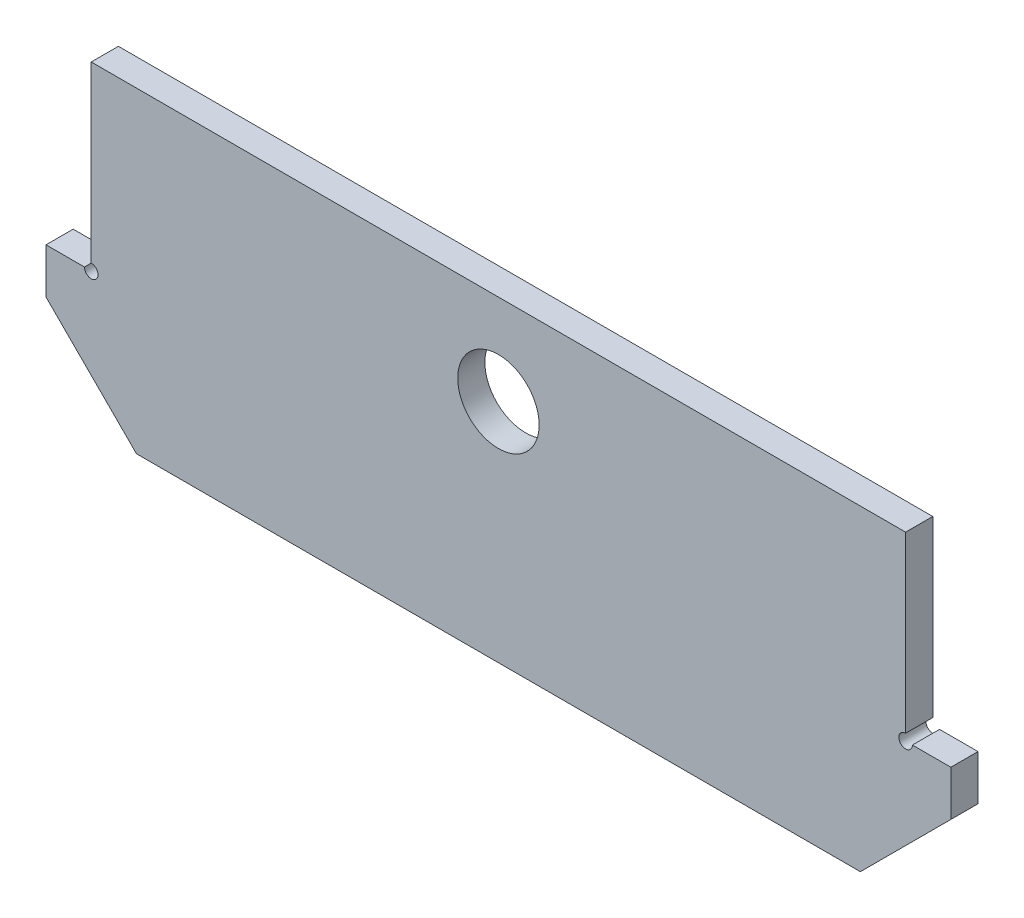
ISO-10303-21;
HEADER;
FILE_DESCRIPTION(('STEP AP214'),'2;1');
FILE_NAME('part.step','',(''),(''),'','','');
FILE_SCHEMA(('AUTOMOTIVE_DESIGN { 1 0 10303 214 1 1 1 1 }'));
ENDSEC;
DATA;
#1=APPLICATION_CONTEXT('core data for automotive mechanical design processes');
#2=APPLICATION_PROTOCOL_DEFINITION('international standard','automotive_design',2000,#1);
#3=PRODUCT_CONTEXT('',#1,'mechanical');
#4=PRODUCT('Part','Part','',(#3));
#5=PRODUCT_RELATED_PRODUCT_CATEGORY('part','',(#4));
#6=PRODUCT_DEFINITION_FORMATION('','',#4);
#7=PRODUCT_DEFINITION_CONTEXT('part definition',#1,'design');
#8=PRODUCT_DEFINITION('design','',#6,#7);
#9=PRODUCT_DEFINITION_SHAPE('','',#8);
#10=(LENGTH_UNIT() NAMED_UNIT(*) SI_UNIT(.MILLI.,.METRE.));
#11=(NAMED_UNIT(*) PLANE_ANGLE_UNIT() SI_UNIT($,.RADIAN.));
#12=(NAMED_UNIT(*) SI_UNIT($,.STERADIAN.) SOLID_ANGLE_UNIT());
#13=UNCERTAINTY_MEASURE_WITH_UNIT(LENGTH_MEASURE(1.E-05),#10,'distance_accuracy_value','');
#14=(GEOMETRIC_REPRESENTATION_CONTEXT(3) GLOBAL_UNCERTAINTY_ASSIGNED_CONTEXT((#13)) GLOBAL_UNIT_ASSIGNED_CONTEXT((#10,
#11,#12)) REPRESENTATION_CONTEXT('',''));
#15=CARTESIAN_POINT('',(0.,0.,0.));
#16=DIRECTION('',(0.,0.,1.));
#17=DIRECTION('',(1.,0.,0.));
#18=AXIS2_PLACEMENT_3D('',#15,#16,#17);
#19=CARTESIAN_POINT('',(234.558896816398,-1478.42666599479,-18.956397504259));
#20=DIRECTION('',(0.,0.,1.));
#21=DIRECTION('',(1.,0.,0.));
#22=AXIS2_PLACEMENT_3D('',#19,#20,#21);
#23=CYLINDRICAL_SURFACE('',#22,1.5000000000003);
#24=DIRECTION('',(0.,0.,1.));
#25=VECTOR('',#24,1.);
#26=CARTESIAN_POINT('',(234.558896816395,-1476.92666599477,-18.956397504259));
#27=LINE('',#26,#25);
#28=CARTESIAN_POINT('',(234.558896816395,-1476.92666599477,-18.956397504259));
#29=VERTEX_POINT('',#28);
#30=CARTESIAN_POINT('',(234.558896816395,-1476.92666599477,-12.956397504259));
#31=VERTEX_POINT('',#30);
#32=EDGE_CURVE('E223',#29,#31,#27,.T.);
#33=ORIENTED_EDGE('',*,*,#32,.T.);
#34=CARTESIAN_POINT('',(234.558896816398,-1478.42666599479,-12.956397504259));
#35=DIRECTION('',(0.,0.,1.));
#36=DIRECTION('',(1.,0.,0.));
#37=AXIS2_PLACEMENT_3D('',#34,#35,#36);
#38=CIRCLE('',#37,1.5000000000003);
#39=CARTESIAN_POINT('',(236.058896816417,-1478.42666599477,-12.956397504259));
#40=VERTEX_POINT('',#39);
#41=EDGE_CURVE('E217',#31,#40,#38,.T.);
#42=ORIENTED_EDGE('',*,*,#41,.T.);
#43=DIRECTION('',(0.,0.,1.));
#44=VECTOR('',#43,1.);
#45=CARTESIAN_POINT('',(236.058896816417,-1478.42666599477,-18.956397504259));
#46=LINE('',#45,#44);
#47=CARTESIAN_POINT('',(236.058896816417,-1478.42666599477,-18.956397504259));
#48=VERTEX_POINT('',#47);
#49=EDGE_CURVE('E12',#48,#40,#46,.T.);
#50=ORIENTED_EDGE('',*,*,#49,.F.);
#51=CARTESIAN_POINT('',(234.558896816398,-1478.42666599479,-18.956397504259));
#52=DIRECTION('',(0.,0.,1.));
#53=DIRECTION('',(1.,0.,0.));
#54=AXIS2_PLACEMENT_3D('',#51,#52,#53);
#55=CIRCLE('',#54,1.5000000000003);
#56=EDGE_CURVE('E259',#29,#48,#55,.T.);
#57=ORIENTED_EDGE('',*,*,#56,.F.);
#58=EDGE_LOOP('',(#33,#42,#50,#57));
#59=FACE_BOUND('',#58,.T.);
#60=ADVANCED_FACE('F114',(#59),#23,.F.);
#61=CARTESIAN_POINT('',(-399855.44110319,-1478.42666600366,-18.956397504259));
#62=DIRECTION('',(0.,-1.,0.));
#63=DIRECTION('',(1.,0.,0.));
#64=AXIS2_PLACEMENT_3D('',#61,#62,#63);
#65=PLANE('',#64);
#66=ORIENTED_EDGE('',*,*,#49,.T.);
#67=DIRECTION('',(1.,0.,0.));
#68=VECTOR('',#67,1.);
#69=CARTESIAN_POINT('',(-399855.44110319,-1478.42666600366,-12.956397504259));
#70=LINE('',#69,#68);
#71=CARTESIAN_POINT('',(244.558896816386,-1478.42666599479,-12.956397504259));
#72=VERTEX_POINT('',#71);
#73=EDGE_CURVE('E206',#40,#72,#70,.T.);
#74=ORIENTED_EDGE('',*,*,#73,.T.);
#75=DIRECTION('',(0.,0.,1.));
#76=VECTOR('',#75,1.);
#77=CARTESIAN_POINT('',(244.558896816386,-1478.42666599479,-18.956397504259));
#78=LINE('',#77,#76);
#79=CARTESIAN_POINT('',(244.558896816386,-1478.42666599479,-18.956397504259));
#80=VERTEX_POINT('',#79);
#81=EDGE_CURVE('E121',#80,#72,#78,.T.);
#82=ORIENTED_EDGE('',*,*,#81,.F.);
#83=DIRECTION('',(1.,0.,0.));
#84=VECTOR('',#83,1.);
#85=CARTESIAN_POINT('',(-399855.44110319,-1478.42666600366,-18.956397504259));
#86=LINE('',#85,#84);
#87=EDGE_CURVE('E207',#48,#80,#86,.T.);
#88=ORIENTED_EDGE('',*,*,#87,.F.);
#89=EDGE_LOOP('',(#66,#74,#82,#88));
#90=FACE_BOUND('',#89,.T.);
#91=ADVANCED_FACE('F204',(#90),#65,.F.);
#92=CARTESIAN_POINT('',(244.558896816386,-291723.426665995,-18.956397504259));
#93=DIRECTION('',(-1.,0.,0.));
#94=DIRECTION('',(0.,0.,1.));
#95=AXIS2_PLACEMENT_3D('',#92,#93,#94);
#96=PLANE('',#95);
#97=ORIENTED_EDGE('',*,*,#81,.T.);
#98=DIRECTION('',(0.,-1.,0.));
#99=VECTOR('',#98,1.);
#100=CARTESIAN_POINT('',(244.558896816386,-291723.426665995,-12.956397504259));
#101=LINE('',#100,#99);
#102=CARTESIAN_POINT('',(244.558896816443,-1488.42666599478,-12.956397504259));
#103=VERTEX_POINT('',#102);
#104=EDGE_CURVE('E221',#72,#103,#101,.T.);
#105=ORIENTED_EDGE('',*,*,#104,.T.);
#106=DIRECTION('',(0.,0.,1.));
#107=VECTOR('',#106,1.);
#108=CARTESIAN_POINT('',(244.558896816443,-1488.42666599478,-18.956397504259));
#109=LINE('',#108,#107);
#110=CARTESIAN_POINT('',(244.558896816443,-1488.42666599478,-18.956397504259));
#111=VERTEX_POINT('',#110);
#112=EDGE_CURVE('E302',#111,#103,#109,.T.);
#113=ORIENTED_EDGE('',*,*,#112,.F.);
#114=DIRECTION('',(0.,-1.,0.));
#115=VECTOR('',#114,1.);
#116=CARTESIAN_POINT('',(244.558896816386,-291723.426665995,-18.956397504259));
#117=LINE('',#116,#115);
#118=EDGE_CURVE('E262',#80,#111,#117,.T.);
#119=ORIENTED_EDGE('',*,*,#118,.F.);
#120=EDGE_LOOP('',(#97,#105,#113,#119));
#121=FACE_BOUND('',#120,.T.);
#122=ADVANCED_FACE('F305',(#121),#96,.F.);
#123=CARTESIAN_POINT('',(-344922.941103184,-346655.926665995,-18.956397504259));
#124=DIRECTION('',(-0.707106781186547,0.707106781186547,0.));
#125=DIRECTION('',(-0.707106781186548,-0.707106781186548,0.));
#126=AXIS2_PLACEMENT_3D('',#123,#124,#125);
#127=PLANE('',#126);
#128=ORIENTED_EDGE('',*,*,#112,.T.);
#129=DIRECTION('',(-0.707106781186548,-0.707106781186548,0.));
#130=VECTOR('',#129,1.);
#131=CARTESIAN_POINT('',(-344922.941103184,-346655.926665995,-12.956397504259));
#132=LINE('',#131,#130);
#133=CARTESIAN_POINT('',(224.558896816461,-1508.42666599476,-12.956397504259));
#134=VERTEX_POINT('',#133);
#135=EDGE_CURVE('E230',#103,#134,#132,.T.);
#136=ORIENTED_EDGE('',*,*,#135,.T.);
#137=DIRECTION('',(0.,0.,1.));
#138=VECTOR('',#137,1.);
#139=CARTESIAN_POINT('',(224.558896816461,-1508.42666599476,-18.956397504259));
#140=LINE('',#139,#138);
#141=CARTESIAN_POINT('',(224.558896816461,-1508.42666599476,-18.956397504259));
#142=VERTEX_POINT('',#141);
#143=EDGE_CURVE('E300',#142,#134,#140,.T.);
#144=ORIENTED_EDGE('',*,*,#143,.F.);
#145=DIRECTION('',(-0.707106781186548,-0.707106781186548,0.));
#146=VECTOR('',#145,1.);
#147=CARTESIAN_POINT('',(-344922.941103184,-346655.926665995,-18.956397504259));
#148=LINE('',#147,#146);
#149=EDGE_CURVE('E264',#111,#142,#148,.T.);
#150=ORIENTED_EDGE('',*,*,#149,.F.);
#151=EDGE_LOOP('',(#128,#136,#144,#150));
#152=FACE_BOUND('',#151,.T.);
#153=ADVANCED_FACE('F313',(#152),#127,.F.);
#154=CARTESIAN_POINT('',(-399855.441103184,-1508.42666599476,-18.956397504259));
#155=DIRECTION('',(0.,-1.,0.));
#156=DIRECTION('',(0.,0.,-1.));
#157=AXIS2_PLACEMENT_3D('',#154,#155,#156);
#158=PLANE('',#157);
#159=ORIENTED_EDGE('',*,*,#143,.T.);
#160=DIRECTION('',(1.,0.,0.));
#161=VECTOR('',#160,1.);
#162=CARTESIAN_POINT('',(-399855.441103184,-1508.42666599476,-12.956397504259));
#163=LINE('',#162,#161);
#164=CARTESIAN_POINT('',(64.5588968163651,-1508.42666599477,-12.956397504259));
#165=VERTEX_POINT('',#164);
#166=EDGE_CURVE('E233',#165,#134,#163,.T.);
#167=ORIENTED_EDGE('',*,*,#166,.F.);
#168=DIRECTION('',(0.,0.,1.));
#169=VECTOR('',#168,1.);
#170=CARTESIAN_POINT('',(64.5588968163651,-1508.42666599477,-18.956397504259));
#171=LINE('',#170,#169);
#172=CARTESIAN_POINT('',(64.5588968163651,-1508.42666599477,-18.956397504259));
#173=VERTEX_POINT('',#172);
#174=EDGE_CURVE('E298',#173,#165,#171,.T.);
#175=ORIENTED_EDGE('',*,*,#174,.F.);
#176=DIRECTION('',(1.,0.,0.));
#177=VECTOR('',#176,1.);
#178=CARTESIAN_POINT('',(-399855.441103184,-1508.42666599476,-18.956397504259));
#179=LINE('',#178,#177);
#180=EDGE_CURVE('E266',#173,#142,#179,.T.);
#181=ORIENTED_EDGE('',*,*,#180,.T.);
#182=EDGE_LOOP('',(#159,#167,#175,#181));
#183=FACE_BOUND('',#182,.T.);
#184=ADVANCED_FACE('F316',(#183),#158,.T.);
#185=CARTESIAN_POINT('',(-54787.9411031833,53344.073334005,-18.956397504259));
#186=DIRECTION('',(-0.707106781186548,-0.707106781186547,0.));
#187=DIRECTION('',(0.707106781186547,-0.707106781186548,0.));
#188=AXIS2_PLACEMENT_3D('',#185,#186,#187);
#189=PLANE('',#188);
#190=ORIENTED_EDGE('',*,*,#174,.T.);
#191=DIRECTION('',(0.707106781186547,-0.707106781186548,0.));
#192=VECTOR('',#191,1.);
#193=CARTESIAN_POINT('',(-54787.9411031833,53344.073334005,-12.956397504259));
#194=LINE('',#193,#192);
#195=CARTESIAN_POINT('',(44.5588968163975,-1488.42666599478,-12.956397504259));
#196=VERTEX_POINT('',#195);
#197=EDGE_CURVE('E236',#196,#165,#194,.T.);
#198=ORIENTED_EDGE('',*,*,#197,.F.);
#199=DIRECTION('',(0.,0.,1.));
#200=VECTOR('',#199,1.);
#201=CARTESIAN_POINT('',(44.5588968163975,-1488.42666599478,-18.956397504259));
#202=LINE('',#201,#200);
#203=CARTESIAN_POINT('',(44.5588968163975,-1488.42666599478,-18.956397504259));
#204=VERTEX_POINT('',#203);
#205=EDGE_CURVE('E296',#204,#196,#202,.T.);
#206=ORIENTED_EDGE('',*,*,#205,.F.);
#207=DIRECTION('',(0.707106781186547,-0.707106781186548,0.));
#208=VECTOR('',#207,1.);
#209=CARTESIAN_POINT('',(-54787.9411031833,53344.073334005,-18.956397504259));
#210=LINE('',#209,#208);
#211=EDGE_CURVE('E269',#204,#173,#210,.T.);
#212=ORIENTED_EDGE('',*,*,#211,.T.);
#213=EDGE_LOOP('',(#190,#198,#206,#212));
#214=FACE_BOUND('',#213,.T.);
#215=ADVANCED_FACE('F319',(#214),#189,.T.);
#216=CARTESIAN_POINT('',(44.5588968163975,-291723.426665995,-18.956397504259));
#217=DIRECTION('',(-1.,0.,0.));
#218=DIRECTION('',(0.,0.,1.));
#219=AXIS2_PLACEMENT_3D('',#216,#217,#218);
#220=PLANE('',#219);
#221=ORIENTED_EDGE('',*,*,#205,.T.);
#222=DIRECTION('',(0.,-1.,0.));
#223=VECTOR('',#222,1.);
#224=CARTESIAN_POINT('',(44.5588968163975,-291723.426665995,-12.956397504259));
#225=LINE('',#224,#223);
#226=CARTESIAN_POINT('',(44.5588968163975,-1478.4266659948,-12.956397504259));
#227=VERTEX_POINT('',#226);
#228=EDGE_CURVE('E239',#227,#196,#225,.T.);
#229=ORIENTED_EDGE('',*,*,#228,.F.);
#230=DIRECTION('',(0.,0.,1.));
#231=VECTOR('',#230,1.);
#232=CARTESIAN_POINT('',(44.5588968163975,-1478.4266659948,-18.956397504259));
#233=LINE('',#232,#231);
#234=CARTESIAN_POINT('',(44.5588968163975,-1478.4266659948,-18.956397504259));
#235=VERTEX_POINT('',#234);
#236=EDGE_CURVE('E294',#235,#227,#233,.T.);
#237=ORIENTED_EDGE('',*,*,#236,.F.);
#238=DIRECTION('',(0.,-1.,0.));
#239=VECTOR('',#238,1.);
#240=CARTESIAN_POINT('',(44.5588968163975,-291723.426665995,-18.956397504259));
#241=LINE('',#240,#239);
#242=EDGE_CURVE('E272',#235,#204,#241,.T.);
#243=ORIENTED_EDGE('',*,*,#242,.T.);
#244=EDGE_LOOP('',(#221,#229,#237,#243));
#245=FACE_BOUND('',#244,.T.);
#246=ADVANCED_FACE('F324',(#245),#220,.T.);
#247=CARTESIAN_POINT('',(-399855.441103177,-1478.42666598592,-18.956397504259));
#248=DIRECTION('',(0.,1.,0.));
#249=DIRECTION('',(-1.,0.,0.));
#250=AXIS2_PLACEMENT_3D('',#247,#248,#249);
#251=PLANE('',#250);
#252=ORIENTED_EDGE('',*,*,#236,.T.);
#253=DIRECTION('',(-1.,0.,0.));
#254=VECTOR('',#253,1.);
#255=CARTESIAN_POINT('',(-399855.441103177,-1478.42666598592,-12.956397504259));
#256=LINE('',#255,#254);
#257=CARTESIAN_POINT('',(53.0588968163976,-1478.4266659948,-12.956397504259));
#258=VERTEX_POINT('',#257);
#259=EDGE_CURVE('E242',#258,#227,#256,.T.);
#260=ORIENTED_EDGE('',*,*,#259,.F.);
#261=DIRECTION('',(0.,0.,1.));
#262=VECTOR('',#261,1.);
#263=CARTESIAN_POINT('',(53.0588968163976,-1478.4266659948,-18.956397504259));
#264=LINE('',#263,#262);
#265=CARTESIAN_POINT('',(53.0588968163976,-1478.4266659948,-18.956397504259));
#266=VERTEX_POINT('',#265);
#267=EDGE_CURVE('E292',#266,#258,#264,.T.);
#268=ORIENTED_EDGE('',*,*,#267,.F.);
#269=DIRECTION('',(-1.,0.,0.));
#270=VECTOR('',#269,1.);
#271=CARTESIAN_POINT('',(-399855.441103177,-1478.42666598592,-18.956397504259));
#272=LINE('',#271,#270);
#273=EDGE_CURVE('E275',#266,#235,#272,.T.);
#274=ORIENTED_EDGE('',*,*,#273,.T.);
#275=EDGE_LOOP('',(#252,#260,#268,#274));
#276=FACE_BOUND('',#275,.T.);
#277=ADVANCED_FACE('F328',(#276),#251,.T.);
#278=CARTESIAN_POINT('',(54.5588968163975,-1478.42666599479,-18.956397504259));
#279=DIRECTION('',(0.,0.,1.));
#280=DIRECTION('',(1.,0.,0.));
#281=AXIS2_PLACEMENT_3D('',#278,#279,#280);
#282=CYLINDRICAL_SURFACE('',#281,1.49999999999983);
#283=ORIENTED_EDGE('',*,*,#267,.T.);
#284=CARTESIAN_POINT('',(54.5588968163975,-1478.42666599479,-12.956397504259));
#285=DIRECTION('',(0.,0.,1.));
#286=DIRECTION('',(1.,0.,0.));
#287=AXIS2_PLACEMENT_3D('',#284,#285,#286);
#288=CIRCLE('',#287,1.49999999999983);
#289=CARTESIAN_POINT('',(54.5588968163884,-1476.92666599477,-12.956397504259));
#290=VERTEX_POINT('',#289);
#291=EDGE_CURVE('E245',#258,#290,#288,.T.);
#292=ORIENTED_EDGE('',*,*,#291,.T.);
#293=DIRECTION('',(0.,0.,1.));
#294=VECTOR('',#293,1.);
#295=CARTESIAN_POINT('',(54.5588968163884,-1476.92666599477,-18.956397504259));
#296=LINE('',#295,#294);
#297=CARTESIAN_POINT('',(54.5588968163884,-1476.92666599477,-18.956397504259));
#298=VERTEX_POINT('',#297);
#299=EDGE_CURVE('E290',#298,#290,#296,.T.);
#300=ORIENTED_EDGE('',*,*,#299,.F.);
#301=CARTESIAN_POINT('',(54.5588968163975,-1478.42666599479,-18.956397504259));
#302=DIRECTION('',(0.,0.,1.));
#303=DIRECTION('',(1.,0.,0.));
#304=AXIS2_PLACEMENT_3D('',#301,#302,#303);
#305=CIRCLE('',#304,1.49999999999983);
#306=EDGE_CURVE('E278',#266,#298,#305,.T.);
#307=ORIENTED_EDGE('',*,*,#306,.F.);
#308=EDGE_LOOP('',(#283,#292,#300,#307));
#309=FACE_BOUND('',#308,.T.);
#310=ADVANCED_FACE('F332',(#309),#282,.F.);
#311=CARTESIAN_POINT('',(54.5588968163884,-291723.426665995,-18.956397504259));
#312=DIRECTION('',(-1.,0.,0.));
#313=DIRECTION('',(0.,0.,1.));
#314=AXIS2_PLACEMENT_3D('',#311,#312,#313);
#315=PLANE('',#314);
#316=ORIENTED_EDGE('',*,*,#299,.T.);
#317=DIRECTION('',(0.,-1.,0.));
#318=VECTOR('',#317,1.);
#319=CARTESIAN_POINT('',(54.5588968163884,-291723.426665995,-12.956397504259));
#320=LINE('',#319,#318);
#321=CARTESIAN_POINT('',(54.5588968163884,-1438.42666599477,-12.956397504259));
#322=VERTEX_POINT('',#321);
#323=EDGE_CURVE('E248',#322,#290,#320,.T.);
#324=ORIENTED_EDGE('',*,*,#323,.F.);
#325=DIRECTION('',(0.,0.,1.));
#326=VECTOR('',#325,1.);
#327=CARTESIAN_POINT('',(54.5588968163884,-1438.42666599477,-18.956397504259));
#328=LINE('',#327,#326);
#329=CARTESIAN_POINT('',(54.5588968163884,-1438.42666599477,-18.956397504259));
#330=VERTEX_POINT('',#329);
#331=EDGE_CURVE('E288',#330,#322,#328,.T.);
#332=ORIENTED_EDGE('',*,*,#331,.F.);
#333=DIRECTION('',(0.,-1.,0.));
#334=VECTOR('',#333,1.);
#335=CARTESIAN_POINT('',(54.5588968163884,-291723.426665995,-18.956397504259));
#336=LINE('',#335,#334);
#337=EDGE_CURVE('E280',#330,#298,#336,.T.);
#338=ORIENTED_EDGE('',*,*,#337,.T.);
#339=EDGE_LOOP('',(#316,#324,#332,#338));
#340=FACE_BOUND('',#339,.T.);
#341=ADVANCED_FACE('F337',(#340),#315,.T.);
#342=CARTESIAN_POINT('',(-399855.441103184,-1438.42666599477,-18.956397504259));
#343=DIRECTION('',(0.,1.,0.));
#344=DIRECTION('',(0.,0.,1.));
#345=AXIS2_PLACEMENT_3D('',#342,#343,#344);
#346=PLANE('',#345);
#347=ORIENTED_EDGE('',*,*,#331,.T.);
#348=DIRECTION('',(-1.,0.,0.));
#349=VECTOR('',#348,1.);
#350=CARTESIAN_POINT('',(-399855.441103184,-1438.42666599477,-12.956397504259));
#351=LINE('',#350,#349);
#352=CARTESIAN_POINT('',(234.558896816395,-1438.42666599477,-12.956397504259));
#353=VERTEX_POINT('',#352);
#354=EDGE_CURVE('E251',#353,#322,#351,.T.);
#355=ORIENTED_EDGE('',*,*,#354,.F.);
#356=DIRECTION('',(0.,0.,1.));
#357=VECTOR('',#356,1.);
#358=CARTESIAN_POINT('',(234.558896816395,-1438.42666599477,-18.956397504259));
#359=LINE('',#358,#357);
#360=CARTESIAN_POINT('',(234.558896816395,-1438.42666599477,-18.956397504259));
#361=VERTEX_POINT('',#360);
#362=EDGE_CURVE('E136',#361,#353,#359,.T.);
#363=ORIENTED_EDGE('',*,*,#362,.F.);
#364=DIRECTION('',(-1.,0.,0.));
#365=VECTOR('',#364,1.);
#366=CARTESIAN_POINT('',(-399855.441103184,-1438.42666599477,-18.956397504259));
#367=LINE('',#366,#365);
#368=EDGE_CURVE('E283',#361,#330,#367,.T.);
#369=ORIENTED_EDGE('',*,*,#368,.T.);
#370=EDGE_LOOP('',(#347,#355,#363,#369));
#371=FACE_BOUND('',#370,.T.);
#372=ADVANCED_FACE('F335',(#371),#346,.T.);
#373=CARTESIAN_POINT('',(234.558896816395,-291723.426665995,-18.956397504259));
#374=DIRECTION('',(-1.,0.,0.));
#375=DIRECTION('',(0.,0.,1.));
#376=AXIS2_PLACEMENT_3D('',#373,#374,#375);
#377=PLANE('',#376);
#378=ORIENTED_EDGE('',*,*,#362,.T.);
#379=DIRECTION('',(0.,-1.,0.));
#380=VECTOR('',#379,1.);
#381=CARTESIAN_POINT('',(234.558896816395,-291723.426665995,-12.956397504259));
#382=LINE('',#381,#380);
#383=EDGE_CURVE('E254',#353,#31,#382,.T.);
#384=ORIENTED_EDGE('',*,*,#383,.T.);
#385=ORIENTED_EDGE('',*,*,#32,.F.);
#386=DIRECTION('',(0.,-1.,0.));
#387=VECTOR('',#386,1.);
#388=CARTESIAN_POINT('',(234.558896816395,-291723.426665995,-18.956397504259));
#389=LINE('',#388,#387);
#390=EDGE_CURVE('E128',#361,#29,#389,.T.);
#391=ORIENTED_EDGE('',*,*,#390,.F.);
#392=EDGE_LOOP('',(#378,#384,#385,#391));
#393=FACE_BOUND('',#392,.T.);
#394=ADVANCED_FACE('F344',(#393),#377,.F.);
#395=CARTESIAN_POINT('',(234.558896816398,-1478.42666599479,-18.956397504259));
#396=DIRECTION('',(0.,0.,1.));
#397=DIRECTION('',(1.,0.,0.));
#398=AXIS2_PLACEMENT_3D('',#395,#396,#397);
#399=PLANE('',#398);
#400=CARTESIAN_POINT('',(144.558896816398,-1458.42666599479,-18.956397504259));
#401=DIRECTION('',(0.,0.,1.));
#402=DIRECTION('',(1.,0.,0.));
#403=AXIS2_PLACEMENT_3D('',#400,#401,#402);
#404=CIRCLE('',#403,9.00000000000004);
#405=CARTESIAN_POINT('',(153.558896816398,-1458.42666599479,-18.956397504259));
#406=VERTEX_POINT('',#405);
#407=EDGE_CURVE('E256',#406,#406,#404,.T.);
#408=ORIENTED_EDGE('',*,*,#407,.T.);
#409=EDGE_LOOP('',(#408));
#410=FACE_BOUND('',#409,.T.);
#411=ORIENTED_EDGE('',*,*,#56,.T.);
#412=ORIENTED_EDGE('',*,*,#87,.T.);
#413=ORIENTED_EDGE('',*,*,#118,.T.);
#414=ORIENTED_EDGE('',*,*,#149,.T.);
#415=ORIENTED_EDGE('',*,*,#180,.F.);
#416=ORIENTED_EDGE('',*,*,#211,.F.);
#417=ORIENTED_EDGE('',*,*,#242,.F.);
#418=ORIENTED_EDGE('',*,*,#273,.F.);
#419=ORIENTED_EDGE('',*,*,#306,.T.);
#420=ORIENTED_EDGE('',*,*,#337,.F.);
#421=ORIENTED_EDGE('',*,*,#368,.F.);
#422=ORIENTED_EDGE('',*,*,#390,.T.);
#423=EDGE_LOOP('',(#411,#412,#413,#414,#415,#416,#417,#418,#419,#420,#421,#422));
#424=FACE_BOUND('',#423,.T.);
#425=ADVANCED_FACE('F308',(#410,#424),#399,.F.);
#426=CARTESIAN_POINT('',(144.558896816398,-1458.42666599479,-18.956397504259));
#427=DIRECTION('',(0.,0.,1.));
#428=DIRECTION('',(1.,0.,0.));
#429=AXIS2_PLACEMENT_3D('',#426,#427,#428);
#430=CYLINDRICAL_SURFACE('',#429,9.00000000000004);
#431=ORIENTED_EDGE('',*,*,#407,.F.);
#432=EDGE_LOOP('',(#431));
#433=FACE_BOUND('',#432,.T.);
#434=CARTESIAN_POINT('',(144.558896816398,-1458.42666599479,-12.956397504259));
#435=DIRECTION('',(0.,0.,1.));
#436=DIRECTION('',(1.,0.,0.));
#437=AXIS2_PLACEMENT_3D('',#434,#435,#436);
#438=CIRCLE('',#437,9.00000000000004);
#439=CARTESIAN_POINT('',(153.558896816398,-1458.42666599479,-12.956397504259));
#440=VERTEX_POINT('',#439);
#441=EDGE_CURVE('E224',#440,#440,#438,.T.);
#442=ORIENTED_EDGE('',*,*,#441,.T.);
#443=EDGE_LOOP('',(#442));
#444=FACE_BOUND('',#443,.T.);
#445=ADVANCED_FACE('F402',(#433,#444),#430,.F.);
#446=CARTESIAN_POINT('',(234.558896816398,-1478.42666599479,-12.956397504259));
#447=DIRECTION('',(0.,0.,1.));
#448=DIRECTION('',(1.,0.,0.));
#449=AXIS2_PLACEMENT_3D('',#446,#447,#448);
#450=PLANE('',#449);
#451=ORIENTED_EDGE('',*,*,#41,.F.);
#452=ORIENTED_EDGE('',*,*,#383,.F.);
#453=ORIENTED_EDGE('',*,*,#354,.T.);
#454=ORIENTED_EDGE('',*,*,#323,.T.);
#455=ORIENTED_EDGE('',*,*,#291,.F.);
#456=ORIENTED_EDGE('',*,*,#259,.T.);
#457=ORIENTED_EDGE('',*,*,#228,.T.);
#458=ORIENTED_EDGE('',*,*,#197,.T.);
#459=ORIENTED_EDGE('',*,*,#166,.T.);
#460=ORIENTED_EDGE('',*,*,#135,.F.);
#461=ORIENTED_EDGE('',*,*,#104,.F.);
#462=ORIENTED_EDGE('',*,*,#73,.F.);
#463=EDGE_LOOP('',(#451,#452,#453,#454,#455,#456,#457,#458,#459,#460,#461,#462));
#464=FACE_BOUND('',#463,.T.);
#465=ORIENTED_EDGE('',*,*,#441,.F.);
#466=EDGE_LOOP('',(#465));
#467=FACE_BOUND('',#466,.T.);
#468=ADVANCED_FACE('F214',(#464,#467),#450,.T.);
#469=CLOSED_SHELL('',(#60,#91,#122,#153,#184,#215,#246,#277,#310,#341,#372,#394,#425,#445,#468));
#470=MANIFOLD_SOLID_BREP('B2',#469);
#471=ADVANCED_BREP_SHAPE_REPRESENTATION('',(#18,#470),#14);
#472=SHAPE_DEFINITION_REPRESENTATION(#9,#471);
ENDSEC;
END-ISO-10303-21;
